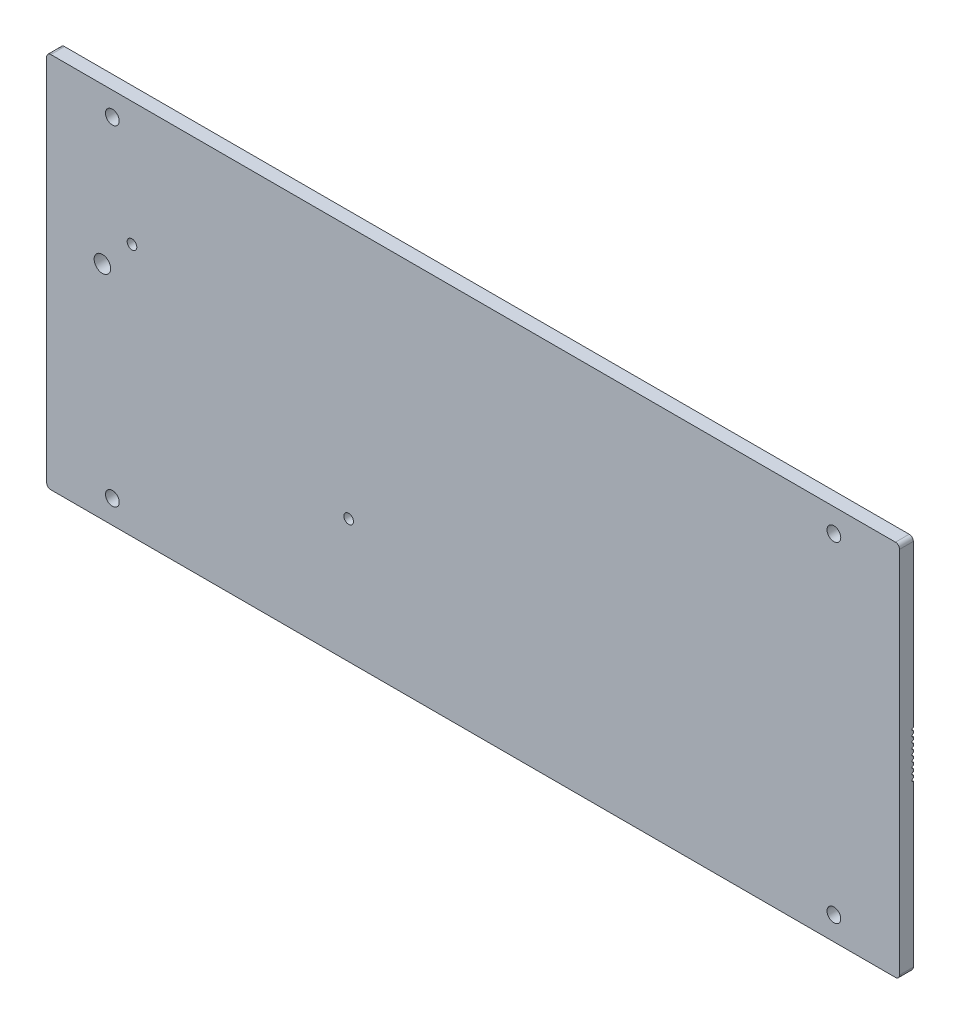
ISO-10303-21;
HEADER;
FILE_DESCRIPTION(('STEP AP214'),'2;1');
FILE_NAME('part.step','',(''),(''),'','','');
FILE_SCHEMA(('AUTOMOTIVE_DESIGN { 1 0 10303 214 1 1 1 1 }'));
ENDSEC;
DATA;
#1=APPLICATION_CONTEXT('core data for automotive mechanical design processes');
#2=APPLICATION_PROTOCOL_DEFINITION('international standard','automotive_design',2000,#1);
#3=PRODUCT_CONTEXT('',#1,'mechanical');
#4=PRODUCT('Part','Part','',(#3));
#5=PRODUCT_RELATED_PRODUCT_CATEGORY('part','',(#4));
#6=PRODUCT_DEFINITION_FORMATION('','',#4);
#7=PRODUCT_DEFINITION_CONTEXT('part definition',#1,'design');
#8=PRODUCT_DEFINITION('design','',#6,#7);
#9=PRODUCT_DEFINITION_SHAPE('','',#8);
#10=(LENGTH_UNIT() NAMED_UNIT(*) SI_UNIT(.MILLI.,.METRE.));
#11=(NAMED_UNIT(*) PLANE_ANGLE_UNIT() SI_UNIT($,.RADIAN.));
#12=(NAMED_UNIT(*) SI_UNIT($,.STERADIAN.) SOLID_ANGLE_UNIT());
#13=UNCERTAINTY_MEASURE_WITH_UNIT(LENGTH_MEASURE(1.E-05),#10,'distance_accuracy_value','');
#14=(GEOMETRIC_REPRESENTATION_CONTEXT(3) GLOBAL_UNCERTAINTY_ASSIGNED_CONTEXT((#13)) GLOBAL_UNIT_ASSIGNED_CONTEXT((#10,
#11,#12)) REPRESENTATION_CONTEXT('',''));
#15=CARTESIAN_POINT('',(0.,0.,0.));
#16=DIRECTION('',(0.,0.,1.));
#17=DIRECTION('',(1.,0.,0.));
#18=AXIS2_PLACEMENT_3D('',#15,#16,#17);
#19=CARTESIAN_POINT('',(-153.5,-67.,0.));
#20=DIRECTION('',(0.,0.,-1.));
#21=DIRECTION('',(-1.,0.,0.));
#22=AXIS2_PLACEMENT_3D('',#19,#20,#21);
#23=PLANE('',#22);
#24=DIRECTION('',(1.,0.,0.));
#25=VECTOR('',#24,1.);
#26=CARTESIAN_POINT('',(-155.,-7.5,0.));
#27=LINE('',#26,#25);
#28=CARTESIAN_POINT('',(-155.,-7.5,0.));
#29=VERTEX_POINT('',#28);
#30=CARTESIAN_POINT('',(155.,-7.5,0.));
#31=VERTEX_POINT('',#30);
#32=EDGE_CURVE('E325',#29,#31,#27,.T.);
#33=ORIENTED_EDGE('',*,*,#32,.F.);
#34=DIRECTION('',(0.,-1.,0.));
#35=VECTOR('',#34,1.);
#36=CARTESIAN_POINT('',(-155.,-67.,0.));
#37=LINE('',#36,#35);
#38=CARTESIAN_POINT('',(-155.,-6.5,0.));
#39=VERTEX_POINT('',#38);
#40=EDGE_CURVE('E448',#39,#29,#37,.T.);
#41=ORIENTED_EDGE('',*,*,#40,.F.);
#42=DIRECTION('',(1.,0.,0.));
#43=VECTOR('',#42,1.);
#44=CARTESIAN_POINT('',(-155.,-6.5,0.));
#45=LINE('',#44,#43);
#46=CARTESIAN_POINT('',(155.,-6.5,0.));
#47=VERTEX_POINT('',#46);
#48=EDGE_CURVE('E319',#47,#39,#45,.F.);
#49=ORIENTED_EDGE('',*,*,#48,.F.);
#50=DIRECTION('',(0.,1.,0.));
#51=VECTOR('',#50,1.);
#52=CARTESIAN_POINT('',(155.,-67.,0.));
#53=LINE('',#52,#51);
#54=EDGE_CURVE('E439',#31,#47,#53,.T.);
#55=ORIENTED_EDGE('',*,*,#54,.F.);
#56=EDGE_LOOP('',(#33,#41,#49,#55));
#57=FACE_BOUND('',#56,.T.);
#58=ADVANCED_FACE('F37',(#57),#23,.T.);
#59=DIRECTION('',(1.,0.,0.));
#60=VECTOR('',#59,1.);
#61=CARTESIAN_POINT('',(-155.,-5.5,0.));
#62=LINE('',#61,#60);
#63=CARTESIAN_POINT('',(-155.,-5.5,0.));
#64=VERTEX_POINT('',#63);
#65=CARTESIAN_POINT('',(155.,-5.5,0.));
#66=VERTEX_POINT('',#65);
#67=EDGE_CURVE('E321',#64,#66,#62,.T.);
#68=ORIENTED_EDGE('',*,*,#67,.F.);
#69=CARTESIAN_POINT('',(-155.,-4.5,0.));
#70=VERTEX_POINT('',#69);
#71=EDGE_CURVE('E451',#70,#64,#37,.T.);
#72=ORIENTED_EDGE('',*,*,#71,.F.);
#73=DIRECTION('',(1.,0.,0.));
#74=VECTOR('',#73,1.);
#75=CARTESIAN_POINT('',(-155.,-4.5,0.));
#76=LINE('',#75,#74);
#77=CARTESIAN_POINT('',(155.,-4.5,0.));
#78=VERTEX_POINT('',#77);
#79=EDGE_CURVE('E315',#78,#70,#76,.F.);
#80=ORIENTED_EDGE('',*,*,#79,.F.);
#81=EDGE_CURVE('E471',#66,#78,#53,.T.);
#82=ORIENTED_EDGE('',*,*,#81,.F.);
#83=EDGE_LOOP('',(#68,#72,#80,#82));
#84=FACE_BOUND('',#83,.T.);
#85=ADVANCED_FACE('F510',(#84),#23,.T.);
#86=DIRECTION('',(1.,0.,0.));
#87=VECTOR('',#86,1.);
#88=CARTESIAN_POINT('',(-155.,-3.5,0.));
#89=LINE('',#88,#87);
#90=CARTESIAN_POINT('',(-155.,-3.5,0.));
#91=VERTEX_POINT('',#90);
#92=CARTESIAN_POINT('',(155.,-3.5,0.));
#93=VERTEX_POINT('',#92);
#94=EDGE_CURVE('E317',#91,#93,#89,.T.);
#95=ORIENTED_EDGE('',*,*,#94,.F.);
#96=CARTESIAN_POINT('',(-155.,-2.5,0.));
#97=VERTEX_POINT('',#96);
#98=EDGE_CURVE('E251',#97,#91,#37,.T.);
#99=ORIENTED_EDGE('',*,*,#98,.F.);
#100=DIRECTION('',(1.,0.,0.));
#101=VECTOR('',#100,1.);
#102=CARTESIAN_POINT('',(-155.,-2.5,0.));
#103=LINE('',#102,#101);
#104=CARTESIAN_POINT('',(155.,-2.5,0.));
#105=VERTEX_POINT('',#104);
#106=EDGE_CURVE('E311',#105,#97,#103,.F.);
#107=ORIENTED_EDGE('',*,*,#106,.F.);
#108=EDGE_CURVE('E463',#93,#105,#53,.T.);
#109=ORIENTED_EDGE('',*,*,#108,.F.);
#110=EDGE_LOOP('',(#95,#99,#107,#109));
#111=FACE_BOUND('',#110,.T.);
#112=ADVANCED_FACE('F460',(#111),#23,.T.);
#113=DIRECTION('',(1.,0.,0.));
#114=VECTOR('',#113,1.);
#115=CARTESIAN_POINT('',(-155.,-1.5,0.));
#116=LINE('',#115,#114);
#117=CARTESIAN_POINT('',(-155.,-1.5,0.));
#118=VERTEX_POINT('',#117);
#119=CARTESIAN_POINT('',(155.,-1.5,0.));
#120=VERTEX_POINT('',#119);
#121=EDGE_CURVE('E313',#118,#120,#116,.T.);
#122=ORIENTED_EDGE('',*,*,#121,.F.);
#123=CARTESIAN_POINT('',(-155.,-0.5,0.));
#124=VERTEX_POINT('',#123);
#125=EDGE_CURVE('E248',#124,#118,#37,.T.);
#126=ORIENTED_EDGE('',*,*,#125,.F.);
#127=DIRECTION('',(1.,0.,0.));
#128=VECTOR('',#127,1.);
#129=CARTESIAN_POINT('',(-155.,-0.5,0.));
#130=LINE('',#129,#128);
#131=CARTESIAN_POINT('',(155.,-0.5,0.));
#132=VERTEX_POINT('',#131);
#133=EDGE_CURVE('E224',#132,#124,#130,.F.);
#134=ORIENTED_EDGE('',*,*,#133,.F.);
#135=EDGE_CURVE('E475',#120,#132,#53,.T.);
#136=ORIENTED_EDGE('',*,*,#135,.F.);
#137=EDGE_LOOP('',(#122,#126,#134,#136));
#138=FACE_BOUND('',#137,.T.);
#139=ADVANCED_FACE('F650',(#138),#23,.T.);
#140=CARTESIAN_POINT('',(-123.985873587784,23.4999999999989,0.));
#141=DIRECTION('',(0.,0.,-1.));
#142=DIRECTION('',(-1.,0.,0.));
#143=AXIS2_PLACEMENT_3D('',#140,#141,#142);
#144=CIRCLE('',#143,1.75);
#145=CARTESIAN_POINT('',(-125.735873587784,23.4999999999989,0.));
#146=VERTEX_POINT('',#145);
#147=EDGE_CURVE('E560',#146,#146,#144,.T.);
#148=ORIENTED_EDGE('',*,*,#147,.F.);
#149=EDGE_LOOP('',(#148));
#150=FACE_BOUND('',#149,.T.);
#151=DIRECTION('',(1.,0.,0.));
#152=VECTOR('',#151,1.);
#153=CARTESIAN_POINT('',(-155.,8.5,0.));
#154=LINE('',#153,#152);
#155=CARTESIAN_POINT('',(-134.351733035214,8.5,0.));
#156=VERTEX_POINT('',#155);
#157=CARTESIAN_POINT('',(155.,8.5,0.));
#158=VERTEX_POINT('',#157);
#159=EDGE_CURVE('E308',#156,#158,#154,.T.);
#160=ORIENTED_EDGE('',*,*,#159,.F.);
#161=CARTESIAN_POINT('',(-134.746454324871,11.9776709308805,0.));
#162=DIRECTION('',(0.,0.,-1.));
#163=DIRECTION('',(-1.,0.,0.));
#164=AXIS2_PLACEMENT_3D('',#161,#162,#163);
#165=CIRCLE('',#164,3.49999999999999);
#166=CARTESIAN_POINT('',(-135.141175614528,8.5,0.));
#167=VERTEX_POINT('',#166);
#168=EDGE_CURVE('E51',#156,#167,#165,.F.);
#169=ORIENTED_EDGE('',*,*,#168,.T.);
#170=CARTESIAN_POINT('',(-155.,8.5,0.));
#171=VERTEX_POINT('',#170);
#172=EDGE_CURVE('E309',#171,#167,#154,.T.);
#173=ORIENTED_EDGE('',*,*,#172,.F.);
#174=CARTESIAN_POINT('',(-155.,67.,0.));
#175=VERTEX_POINT('',#174);
#176=EDGE_CURVE('E252',#175,#171,#37,.T.);
#177=ORIENTED_EDGE('',*,*,#176,.F.);
#178=CARTESIAN_POINT('',(-153.5,67.,0.));
#179=DIRECTION('',(0.,0.,1.));
#180=DIRECTION('',(-1.,0.,0.));
#181=AXIS2_PLACEMENT_3D('',#178,#179,#180);
#182=CIRCLE('',#181,1.5);
#183=CARTESIAN_POINT('',(-153.5,68.5,0.));
#184=VERTEX_POINT('',#183);
#185=EDGE_CURVE('E260',#184,#175,#182,.T.);
#186=ORIENTED_EDGE('',*,*,#185,.F.);
#187=DIRECTION('',(-1.,0.,0.));
#188=VECTOR('',#187,1.);
#189=CARTESIAN_POINT('',(-153.5,68.5,0.));
#190=LINE('',#189,#188);
#191=CARTESIAN_POINT('',(153.5,68.5,0.));
#192=VERTEX_POINT('',#191);
#193=EDGE_CURVE('E440',#192,#184,#190,.T.);
#194=ORIENTED_EDGE('',*,*,#193,.F.);
#195=CARTESIAN_POINT('',(153.5,67.,0.));
#196=DIRECTION('',(0.,0.,1.));
#197=DIRECTION('',(-1.,0.,0.));
#198=AXIS2_PLACEMENT_3D('',#195,#196,#197);
#199=CIRCLE('',#198,1.5);
#200=CARTESIAN_POINT('',(155.,67.,0.));
#201=VERTEX_POINT('',#200);
#202=EDGE_CURVE('E438',#201,#192,#199,.T.);
#203=ORIENTED_EDGE('',*,*,#202,.F.);
#204=EDGE_CURVE('E434',#158,#201,#53,.T.);
#205=ORIENTED_EDGE('',*,*,#204,.F.);
#206=EDGE_LOOP('',(#160,#169,#173,#177,#186,#194,#203,#205));
#207=FACE_BOUND('',#206,.T.);
#208=CARTESIAN_POINT('',(131.119201541393,60.0000000000007,0.));
#209=DIRECTION('',(0.,0.,-1.));
#210=DIRECTION('',(1.,0.,0.));
#211=AXIS2_PLACEMENT_3D('',#208,#209,#210);
#212=CIRCLE('',#211,2.5);
#213=CARTESIAN_POINT('',(133.619201541393,60.0000000000007,0.));
#214=VERTEX_POINT('',#213);
#215=EDGE_CURVE('E391',#214,#214,#212,.T.);
#216=ORIENTED_EDGE('',*,*,#215,.F.);
#217=EDGE_LOOP('',(#216));
#218=FACE_BOUND('',#217,.T.);
#219=CARTESIAN_POINT('',(-131.119201541393,60.0000000000007,0.));
#220=DIRECTION('',(0.,0.,-1.));
#221=DIRECTION('',(-1.,0.,0.));
#222=AXIS2_PLACEMENT_3D('',#219,#220,#221);
#223=CIRCLE('',#222,2.50000000000064);
#224=CARTESIAN_POINT('',(-133.619201541394,60.0000000000007,0.));
#225=VERTEX_POINT('',#224);
#226=EDGE_CURVE('E397',#225,#225,#223,.T.);
#227=ORIENTED_EDGE('',*,*,#226,.F.);
#228=EDGE_LOOP('',(#227));
#229=FACE_BOUND('',#228,.T.);
#230=ADVANCED_FACE('F331',(#150,#207,#218,#229),#23,.T.);
#231=DIRECTION('',(1.,0.,0.));
#232=VECTOR('',#231,1.);
#233=CARTESIAN_POINT('',(-155.,7.5,0.));
#234=LINE('',#233,#232);
#235=CARTESIAN_POINT('',(155.,7.50000000000001,0.));
#236=VERTEX_POINT('',#235);
#237=CARTESIAN_POINT('',(-155.,7.5,0.));
#238=VERTEX_POINT('',#237);
#239=EDGE_CURVE('E305',#236,#238,#234,.F.);
#240=ORIENTED_EDGE('',*,*,#239,.F.);
#241=CARTESIAN_POINT('',(155.,6.5,0.));
#242=VERTEX_POINT('',#241);
#243=EDGE_CURVE('E483',#242,#236,#53,.T.);
#244=ORIENTED_EDGE('',*,*,#243,.F.);
#245=DIRECTION('',(1.,0.,0.));
#246=VECTOR('',#245,1.);
#247=CARTESIAN_POINT('',(-155.,6.5,0.));
#248=LINE('',#247,#246);
#249=CARTESIAN_POINT('',(-155.,6.5,0.));
#250=VERTEX_POINT('',#249);
#251=EDGE_CURVE('E302',#250,#242,#248,.T.);
#252=ORIENTED_EDGE('',*,*,#251,.F.);
#253=EDGE_CURVE('E258',#238,#250,#37,.T.);
#254=ORIENTED_EDGE('',*,*,#253,.F.);
#255=EDGE_LOOP('',(#240,#244,#252,#254));
#256=FACE_BOUND('',#255,.T.);
#257=ADVANCED_FACE('F547',(#256),#23,.T.);
#258=DIRECTION('',(1.,0.,0.));
#259=VECTOR('',#258,1.);
#260=CARTESIAN_POINT('',(-155.,5.5,0.));
#261=LINE('',#260,#259);
#262=CARTESIAN_POINT('',(155.,5.50000000000001,0.));
#263=VERTEX_POINT('',#262);
#264=CARTESIAN_POINT('',(-155.,5.5,0.));
#265=VERTEX_POINT('',#264);
#266=EDGE_CURVE('E299',#263,#265,#261,.F.);
#267=ORIENTED_EDGE('',*,*,#266,.F.);
#268=CARTESIAN_POINT('',(155.,4.5,0.));
#269=VERTEX_POINT('',#268);
#270=EDGE_CURVE('E480',#269,#263,#53,.T.);
#271=ORIENTED_EDGE('',*,*,#270,.F.);
#272=DIRECTION('',(1.,0.,0.));
#273=VECTOR('',#272,1.);
#274=CARTESIAN_POINT('',(-155.,4.5,0.));
#275=LINE('',#274,#273);
#276=CARTESIAN_POINT('',(-155.,4.5,0.));
#277=VERTEX_POINT('',#276);
#278=EDGE_CURVE('E296',#277,#269,#275,.T.);
#279=ORIENTED_EDGE('',*,*,#278,.F.);
#280=EDGE_CURVE('E250',#265,#277,#37,.T.);
#281=ORIENTED_EDGE('',*,*,#280,.F.);
#282=EDGE_LOOP('',(#267,#271,#279,#281));
#283=FACE_BOUND('',#282,.T.);
#284=ADVANCED_FACE('F542',(#283),#23,.T.);
#285=DIRECTION('',(1.,0.,0.));
#286=VECTOR('',#285,1.);
#287=CARTESIAN_POINT('',(-155.,3.5,0.));
#288=LINE('',#287,#286);
#289=CARTESIAN_POINT('',(155.,3.5,0.));
#290=VERTEX_POINT('',#289);
#291=CARTESIAN_POINT('',(-155.,3.5,0.));
#292=VERTEX_POINT('',#291);
#293=EDGE_CURVE('E293',#290,#292,#288,.F.);
#294=ORIENTED_EDGE('',*,*,#293,.F.);
#295=CARTESIAN_POINT('',(155.,2.5,0.));
#296=VERTEX_POINT('',#295);
#297=EDGE_CURVE('E478',#296,#290,#53,.T.);
#298=ORIENTED_EDGE('',*,*,#297,.F.);
#299=DIRECTION('',(1.,0.,0.));
#300=VECTOR('',#299,1.);
#301=CARTESIAN_POINT('',(-155.,2.5,0.));
#302=LINE('',#301,#300);
#303=CARTESIAN_POINT('',(-155.,2.5,0.));
#304=VERTEX_POINT('',#303);
#305=EDGE_CURVE('E290',#304,#296,#302,.T.);
#306=ORIENTED_EDGE('',*,*,#305,.F.);
#307=EDGE_CURVE('E247',#292,#304,#37,.T.);
#308=ORIENTED_EDGE('',*,*,#307,.F.);
#309=EDGE_LOOP('',(#294,#298,#306,#308));
#310=FACE_BOUND('',#309,.T.);
#311=ADVANCED_FACE('F535',(#310),#23,.T.);
#312=DIRECTION('',(1.,0.,0.));
#313=VECTOR('',#312,1.);
#314=CARTESIAN_POINT('',(-155.,1.5,0.));
#315=LINE('',#314,#313);
#316=CARTESIAN_POINT('',(155.,1.5,0.));
#317=VERTEX_POINT('',#316);
#318=CARTESIAN_POINT('',(-155.,1.5,0.));
#319=VERTEX_POINT('',#318);
#320=EDGE_CURVE('E241',#317,#319,#315,.F.);
#321=ORIENTED_EDGE('',*,*,#320,.F.);
#322=CARTESIAN_POINT('',(155.,0.5,0.));
#323=VERTEX_POINT('',#322);
#324=EDGE_CURVE('E239',#323,#317,#53,.T.);
#325=ORIENTED_EDGE('',*,*,#324,.F.);
#326=DIRECTION('',(1.,0.,0.));
#327=VECTOR('',#326,1.);
#328=CARTESIAN_POINT('',(-155.,0.5,0.));
#329=LINE('',#328,#327);
#330=CARTESIAN_POINT('',(-155.,0.5,0.));
#331=VERTEX_POINT('',#330);
#332=EDGE_CURVE('E221',#331,#323,#329,.T.);
#333=ORIENTED_EDGE('',*,*,#332,.F.);
#334=EDGE_CURVE('E237',#319,#331,#37,.T.);
#335=ORIENTED_EDGE('',*,*,#334,.F.);
#336=EDGE_LOOP('',(#321,#325,#333,#335));
#337=FACE_BOUND('',#336,.T.);
#338=ADVANCED_FACE('F236',(#337),#23,.T.);
#339=CARTESIAN_POINT('',(-153.5,-67.,5.));
#340=DIRECTION('',(0.,0.,-1.));
#341=DIRECTION('',(-1.,0.,0.));
#342=AXIS2_PLACEMENT_3D('',#339,#340,#341);
#343=CYLINDRICAL_SURFACE('',#342,1.5);
#344=CARTESIAN_POINT('',(-153.5,-67.,0.));
#345=DIRECTION('',(0.,0.,1.));
#346=DIRECTION('',(-1.,0.,0.));
#347=AXIS2_PLACEMENT_3D('',#344,#345,#346);
#348=CIRCLE('',#347,1.5);
#349=CARTESIAN_POINT('',(-155.,-67.,0.));
#350=VERTEX_POINT('',#349);
#351=CARTESIAN_POINT('',(-153.5,-68.5,0.));
#352=VERTEX_POINT('',#351);
#353=EDGE_CURVE('E408',#350,#352,#348,.T.);
#354=ORIENTED_EDGE('',*,*,#353,.T.);
#355=DIRECTION('',(0.,0.,-1.));
#356=VECTOR('',#355,1.);
#357=CARTESIAN_POINT('',(-153.5,-68.5,5.));
#358=LINE('',#357,#356);
#359=CARTESIAN_POINT('',(-153.5,-68.5,5.));
#360=VERTEX_POINT('',#359);
#361=EDGE_CURVE('E284',#360,#352,#358,.T.);
#362=ORIENTED_EDGE('',*,*,#361,.F.);
#363=CARTESIAN_POINT('',(-153.5,-67.,5.));
#364=DIRECTION('',(0.,0.,1.));
#365=DIRECTION('',(-1.,0.,0.));
#366=AXIS2_PLACEMENT_3D('',#363,#364,#365);
#367=CIRCLE('',#366,1.5);
#368=CARTESIAN_POINT('',(-155.,-67.,5.));
#369=VERTEX_POINT('',#368);
#370=EDGE_CURVE('E257',#369,#360,#367,.T.);
#371=ORIENTED_EDGE('',*,*,#370,.F.);
#372=DIRECTION('',(0.,0.,-1.));
#373=VECTOR('',#372,1.);
#374=CARTESIAN_POINT('',(-155.,-67.,5.));
#375=LINE('',#374,#373);
#376=EDGE_CURVE('E262',#369,#350,#375,.T.);
#377=ORIENTED_EDGE('',*,*,#376,.T.);
#378=EDGE_LOOP('',(#354,#362,#371,#377));
#379=FACE_BOUND('',#378,.T.);
#380=ADVANCED_FACE('F534',(#379),#343,.T.);
#381=CARTESIAN_POINT('',(-153.5,-68.5,5.));
#382=DIRECTION('',(0.,1.,0.));
#383=DIRECTION('',(0.,0.,1.));
#384=AXIS2_PLACEMENT_3D('',#381,#382,#383);
#385=PLANE('',#384);
#386=DIRECTION('',(1.,0.,0.));
#387=VECTOR('',#386,1.);
#388=CARTESIAN_POINT('',(-153.5,-68.5,0.));
#389=LINE('',#388,#387);
#390=CARTESIAN_POINT('',(153.5,-68.5,0.));
#391=VERTEX_POINT('',#390);
#392=EDGE_CURVE('E430',#352,#391,#389,.T.);
#393=ORIENTED_EDGE('',*,*,#392,.T.);
#394=DIRECTION('',(0.,0.,-1.));
#395=VECTOR('',#394,1.);
#396=CARTESIAN_POINT('',(153.5,-68.5,5.));
#397=LINE('',#396,#395);
#398=CARTESIAN_POINT('',(153.5,-68.5,5.));
#399=VERTEX_POINT('',#398);
#400=EDGE_CURVE('E281',#399,#391,#397,.T.);
#401=ORIENTED_EDGE('',*,*,#400,.F.);
#402=DIRECTION('',(1.,0.,0.));
#403=VECTOR('',#402,1.);
#404=CARTESIAN_POINT('',(-153.5,-68.5,5.));
#405=LINE('',#404,#403);
#406=EDGE_CURVE('E413',#360,#399,#405,.T.);
#407=ORIENTED_EDGE('',*,*,#406,.F.);
#408=ORIENTED_EDGE('',*,*,#361,.T.);
#409=EDGE_LOOP('',(#393,#401,#407,#408));
#410=FACE_BOUND('',#409,.T.);
#411=ADVANCED_FACE('F540',(#410),#385,.F.);
#412=CARTESIAN_POINT('',(153.5,-67.,5.));
#413=DIRECTION('',(0.,0.,-1.));
#414=DIRECTION('',(-1.,0.,0.));
#415=AXIS2_PLACEMENT_3D('',#412,#413,#414);
#416=CYLINDRICAL_SURFACE('',#415,1.5);
#417=CARTESIAN_POINT('',(153.5,-67.,0.));
#418=DIRECTION('',(0.,0.,1.));
#419=DIRECTION('',(1.,0.,0.));
#420=AXIS2_PLACEMENT_3D('',#417,#418,#419);
#421=CIRCLE('',#420,1.5);
#422=CARTESIAN_POINT('',(155.,-67.,0.));
#423=VERTEX_POINT('',#422);
#424=EDGE_CURVE('E432',#391,#423,#421,.T.);
#425=ORIENTED_EDGE('',*,*,#424,.T.);
#426=DIRECTION('',(0.,0.,-1.));
#427=VECTOR('',#426,1.);
#428=CARTESIAN_POINT('',(155.,-67.,5.));
#429=LINE('',#428,#427);
#430=CARTESIAN_POINT('',(155.,-67.,5.));
#431=VERTEX_POINT('',#430);
#432=EDGE_CURVE('E278',#431,#423,#429,.T.);
#433=ORIENTED_EDGE('',*,*,#432,.F.);
#434=CARTESIAN_POINT('',(153.5,-67.,5.));
#435=DIRECTION('',(0.,0.,1.));
#436=DIRECTION('',(1.,0.,0.));
#437=AXIS2_PLACEMENT_3D('',#434,#435,#436);
#438=CIRCLE('',#437,1.5);
#439=EDGE_CURVE('E415',#399,#431,#438,.T.);
#440=ORIENTED_EDGE('',*,*,#439,.F.);
#441=ORIENTED_EDGE('',*,*,#400,.T.);
#442=EDGE_LOOP('',(#425,#433,#440,#441));
#443=FACE_BOUND('',#442,.T.);
#444=ADVANCED_FACE('F726',(#443),#416,.T.);
#445=CARTESIAN_POINT('',(155.,-67.,5.));
#446=DIRECTION('',(-1.,0.,0.));
#447=DIRECTION('',(0.,0.,1.));
#448=AXIS2_PLACEMENT_3D('',#445,#446,#447);
#449=PLANE('',#448);
#450=CARTESIAN_POINT('',(155.,-8.5,0.));
#451=VERTEX_POINT('',#450);
#452=EDGE_CURVE('E435',#423,#451,#53,.T.);
#453=ORIENTED_EDGE('',*,*,#452,.T.);
#454=CARTESIAN_POINT('',(155.,-8.,0.));
#455=DIRECTION('',(-1.,0.,0.));
#456=DIRECTION('',(0.,0.,1.));
#457=AXIS2_PLACEMENT_3D('',#454,#455,#456);
#458=CIRCLE('',#457,0.5);
#459=EDGE_CURVE('E383',#451,#31,#458,.T.);
#460=ORIENTED_EDGE('',*,*,#459,.T.);
#461=ORIENTED_EDGE('',*,*,#54,.T.);
#462=CARTESIAN_POINT('',(155.,-6.,0.));
#463=DIRECTION('',(-1.,0.,0.));
#464=DIRECTION('',(0.,0.,1.));
#465=AXIS2_PLACEMENT_3D('',#462,#463,#464);
#466=CIRCLE('',#465,0.499999999999999);
#467=EDGE_CURVE('E380',#47,#66,#466,.T.);
#468=ORIENTED_EDGE('',*,*,#467,.T.);
#469=ORIENTED_EDGE('',*,*,#81,.T.);
#470=CARTESIAN_POINT('',(155.,-4.,0.));
#471=DIRECTION('',(-1.,0.,0.));
#472=DIRECTION('',(0.,0.,1.));
#473=AXIS2_PLACEMENT_3D('',#470,#471,#472);
#474=CIRCLE('',#473,0.5);
#475=EDGE_CURVE('E377',#78,#93,#474,.T.);
#476=ORIENTED_EDGE('',*,*,#475,.T.);
#477=ORIENTED_EDGE('',*,*,#108,.T.);
#478=CARTESIAN_POINT('',(155.,-2.,0.));
#479=DIRECTION('',(-1.,0.,0.));
#480=DIRECTION('',(0.,0.,1.));
#481=AXIS2_PLACEMENT_3D('',#478,#479,#480);
#482=CIRCLE('',#481,0.5);
#483=EDGE_CURVE('E374',#105,#120,#482,.T.);
#484=ORIENTED_EDGE('',*,*,#483,.T.);
#485=ORIENTED_EDGE('',*,*,#135,.T.);
#486=CARTESIAN_POINT('',(155.,0.,0.));
#487=DIRECTION('',(-1.,0.,0.));
#488=DIRECTION('',(0.,0.,1.));
#489=AXIS2_PLACEMENT_3D('',#486,#487,#488);
#490=CIRCLE('',#489,0.5);
#491=EDGE_CURVE('E229',#132,#323,#490,.T.);
#492=ORIENTED_EDGE('',*,*,#491,.T.);
#493=ORIENTED_EDGE('',*,*,#324,.T.);
#494=CARTESIAN_POINT('',(155.,2.,0.));
#495=DIRECTION('',(-1.,0.,0.));
#496=DIRECTION('',(0.,0.,1.));
#497=AXIS2_PLACEMENT_3D('',#494,#495,#496);
#498=CIRCLE('',#497,0.5);
#499=EDGE_CURVE('E362',#317,#296,#498,.T.);
#500=ORIENTED_EDGE('',*,*,#499,.T.);
#501=ORIENTED_EDGE('',*,*,#297,.T.);
#502=CARTESIAN_POINT('',(155.,4.,0.));
#503=DIRECTION('',(-1.,0.,0.));
#504=DIRECTION('',(0.,0.,1.));
#505=AXIS2_PLACEMENT_3D('',#502,#503,#504);
#506=CIRCLE('',#505,0.499999999999999);
#507=EDGE_CURVE('E365',#290,#269,#506,.T.);
#508=ORIENTED_EDGE('',*,*,#507,.T.);
#509=ORIENTED_EDGE('',*,*,#270,.T.);
#510=CARTESIAN_POINT('',(155.,6.,0.));
#511=DIRECTION('',(-1.,0.,0.));
#512=DIRECTION('',(0.,0.,1.));
#513=AXIS2_PLACEMENT_3D('',#510,#511,#512);
#514=CIRCLE('',#513,0.499999999999999);
#515=EDGE_CURVE('E368',#263,#242,#514,.T.);
#516=ORIENTED_EDGE('',*,*,#515,.T.);
#517=ORIENTED_EDGE('',*,*,#243,.T.);
#518=CARTESIAN_POINT('',(155.,8.,0.));
#519=DIRECTION('',(-1.,0.,0.));
#520=DIRECTION('',(0.,0.,1.));
#521=AXIS2_PLACEMENT_3D('',#518,#519,#520);
#522=CIRCLE('',#521,0.5);
#523=EDGE_CURVE('E371',#236,#158,#522,.T.);
#524=ORIENTED_EDGE('',*,*,#523,.T.);
#525=ORIENTED_EDGE('',*,*,#204,.T.);
#526=DIRECTION('',(0.,0.,-1.));
#527=VECTOR('',#526,1.);
#528=CARTESIAN_POINT('',(155.,67.,5.));
#529=LINE('',#528,#527);
#530=CARTESIAN_POINT('',(155.,67.,5.));
#531=VERTEX_POINT('',#530);
#532=EDGE_CURVE('E275',#531,#201,#529,.T.);
#533=ORIENTED_EDGE('',*,*,#532,.F.);
#534=DIRECTION('',(0.,1.,0.));
#535=VECTOR('',#534,1.);
#536=CARTESIAN_POINT('',(155.,-67.,5.));
#537=LINE('',#536,#535);
#538=EDGE_CURVE('E417',#431,#531,#537,.T.);
#539=ORIENTED_EDGE('',*,*,#538,.F.);
#540=ORIENTED_EDGE('',*,*,#432,.T.);
#541=EDGE_LOOP('',(#453,#460,#461,#468,#469,#476,#477,#484,#485,#492,#493,#500,#501,#508,#509,
#516,#517,#524,#525,#533,#539,#540));
#542=FACE_BOUND('',#541,.T.);
#543=ADVANCED_FACE('F469',(#542),#449,.F.);
#544=CARTESIAN_POINT('',(153.5,67.,5.));
#545=DIRECTION('',(0.,0.,-1.));
#546=DIRECTION('',(-1.,0.,0.));
#547=AXIS2_PLACEMENT_3D('',#544,#545,#546);
#548=CYLINDRICAL_SURFACE('',#547,1.5);
#549=ORIENTED_EDGE('',*,*,#202,.T.);
#550=DIRECTION('',(0.,0.,-1.));
#551=VECTOR('',#550,1.);
#552=CARTESIAN_POINT('',(153.5,68.5,5.));
#553=LINE('',#552,#551);
#554=CARTESIAN_POINT('',(153.5,68.5,5.));
#555=VERTEX_POINT('',#554);
#556=EDGE_CURVE('E272',#555,#192,#553,.T.);
#557=ORIENTED_EDGE('',*,*,#556,.F.);
#558=CARTESIAN_POINT('',(153.5,67.,5.));
#559=DIRECTION('',(0.,0.,1.));
#560=DIRECTION('',(-1.,0.,0.));
#561=AXIS2_PLACEMENT_3D('',#558,#559,#560);
#562=CIRCLE('',#561,1.5);
#563=EDGE_CURVE('E419',#531,#555,#562,.T.);
#564=ORIENTED_EDGE('',*,*,#563,.F.);
#565=ORIENTED_EDGE('',*,*,#532,.T.);
#566=EDGE_LOOP('',(#549,#557,#564,#565));
#567=FACE_BOUND('',#566,.T.);
#568=ADVANCED_FACE('F492',(#567),#548,.T.);
#569=CARTESIAN_POINT('',(-153.5,68.5,5.));
#570=DIRECTION('',(0.,-1.,0.));
#571=DIRECTION('',(0.,0.,-1.));
#572=AXIS2_PLACEMENT_3D('',#569,#570,#571);
#573=PLANE('',#572);
#574=ORIENTED_EDGE('',*,*,#193,.T.);
#575=DIRECTION('',(0.,0.,-1.));
#576=VECTOR('',#575,1.);
#577=CARTESIAN_POINT('',(-153.5,68.5,5.));
#578=LINE('',#577,#576);
#579=CARTESIAN_POINT('',(-153.5,68.5,5.));
#580=VERTEX_POINT('',#579);
#581=EDGE_CURVE('E269',#580,#184,#578,.T.);
#582=ORIENTED_EDGE('',*,*,#581,.F.);
#583=DIRECTION('',(-1.,0.,0.));
#584=VECTOR('',#583,1.);
#585=CARTESIAN_POINT('',(-153.5,68.5,5.));
#586=LINE('',#585,#584);
#587=EDGE_CURVE('E421',#555,#580,#586,.T.);
#588=ORIENTED_EDGE('',*,*,#587,.F.);
#589=ORIENTED_EDGE('',*,*,#556,.T.);
#590=EDGE_LOOP('',(#574,#582,#588,#589));
#591=FACE_BOUND('',#590,.T.);
#592=ADVANCED_FACE('F500',(#591),#573,.F.);
#593=CARTESIAN_POINT('',(-153.5,67.,5.));
#594=DIRECTION('',(0.,0.,-1.));
#595=DIRECTION('',(-1.,0.,0.));
#596=AXIS2_PLACEMENT_3D('',#593,#594,#595);
#597=CYLINDRICAL_SURFACE('',#596,1.5);
#598=ORIENTED_EDGE('',*,*,#185,.T.);
#599=DIRECTION('',(0.,0.,-1.));
#600=VECTOR('',#599,1.);
#601=CARTESIAN_POINT('',(-155.,67.,5.));
#602=LINE('',#601,#600);
#603=CARTESIAN_POINT('',(-155.,67.,5.));
#604=VERTEX_POINT('',#603);
#605=EDGE_CURVE('E265',#604,#175,#602,.T.);
#606=ORIENTED_EDGE('',*,*,#605,.F.);
#607=CARTESIAN_POINT('',(-153.5,67.,5.));
#608=DIRECTION('',(0.,0.,1.));
#609=DIRECTION('',(-1.,0.,0.));
#610=AXIS2_PLACEMENT_3D('',#607,#608,#609);
#611=CIRCLE('',#610,1.5);
#612=EDGE_CURVE('E424',#580,#604,#611,.T.);
#613=ORIENTED_EDGE('',*,*,#612,.F.);
#614=ORIENTED_EDGE('',*,*,#581,.T.);
#615=EDGE_LOOP('',(#598,#606,#613,#614));
#616=FACE_BOUND('',#615,.T.);
#617=ADVANCED_FACE('F496',(#616),#597,.T.);
#618=CARTESIAN_POINT('',(-155.,-67.,5.));
#619=DIRECTION('',(1.,0.,0.));
#620=DIRECTION('',(0.,0.,-1.));
#621=AXIS2_PLACEMENT_3D('',#618,#619,#620);
#622=PLANE('',#621);
#623=ORIENTED_EDGE('',*,*,#40,.T.);
#624=CARTESIAN_POINT('',(-155.,-8.,0.));
#625=DIRECTION('',(1.,0.,0.));
#626=DIRECTION('',(0.,0.,-1.));
#627=AXIS2_PLACEMENT_3D('',#624,#625,#626);
#628=CIRCLE('',#627,0.5);
#629=CARTESIAN_POINT('',(-155.,-8.5,0.));
#630=VERTEX_POINT('',#629);
#631=EDGE_CURVE('E357',#29,#630,#628,.T.);
#632=ORIENTED_EDGE('',*,*,#631,.T.);
#633=EDGE_CURVE('E259',#630,#350,#37,.T.);
#634=ORIENTED_EDGE('',*,*,#633,.T.);
#635=ORIENTED_EDGE('',*,*,#376,.F.);
#636=DIRECTION('',(0.,-1.,0.));
#637=VECTOR('',#636,1.);
#638=CARTESIAN_POINT('',(-155.,-67.,5.));
#639=LINE('',#638,#637);
#640=EDGE_CURVE('E266',#604,#369,#639,.T.);
#641=ORIENTED_EDGE('',*,*,#640,.F.);
#642=ORIENTED_EDGE('',*,*,#605,.T.);
#643=ORIENTED_EDGE('',*,*,#176,.T.);
#644=CARTESIAN_POINT('',(-155.,8.,0.));
#645=DIRECTION('',(1.,0.,0.));
#646=DIRECTION('',(0.,0.,-1.));
#647=AXIS2_PLACEMENT_3D('',#644,#645,#646);
#648=CIRCLE('',#647,0.5);
#649=EDGE_CURVE('E337',#171,#238,#648,.T.);
#650=ORIENTED_EDGE('',*,*,#649,.T.);
#651=ORIENTED_EDGE('',*,*,#253,.T.);
#652=CARTESIAN_POINT('',(-155.,6.,0.));
#653=DIRECTION('',(1.,0.,0.));
#654=DIRECTION('',(0.,0.,-1.));
#655=AXIS2_PLACEMENT_3D('',#652,#653,#654);
#656=CIRCLE('',#655,0.499999999999999);
#657=EDGE_CURVE('E341',#250,#265,#656,.T.);
#658=ORIENTED_EDGE('',*,*,#657,.T.);
#659=ORIENTED_EDGE('',*,*,#280,.T.);
#660=CARTESIAN_POINT('',(-155.,4.,0.));
#661=DIRECTION('',(1.,0.,0.));
#662=DIRECTION('',(0.,0.,-1.));
#663=AXIS2_PLACEMENT_3D('',#660,#661,#662);
#664=CIRCLE('',#663,0.499999999999999);
#665=EDGE_CURVE('E345',#277,#292,#664,.T.);
#666=ORIENTED_EDGE('',*,*,#665,.T.);
#667=ORIENTED_EDGE('',*,*,#307,.T.);
#668=CARTESIAN_POINT('',(-155.,2.,0.));
#669=DIRECTION('',(1.,0.,0.));
#670=DIRECTION('',(0.,0.,-1.));
#671=AXIS2_PLACEMENT_3D('',#668,#669,#670);
#672=CIRCLE('',#671,0.5);
#673=EDGE_CURVE('E230',#304,#319,#672,.T.);
#674=ORIENTED_EDGE('',*,*,#673,.T.);
#675=ORIENTED_EDGE('',*,*,#334,.T.);
#676=CARTESIAN_POINT('',(-155.,0.,0.));
#677=DIRECTION('',(1.,0.,0.));
#678=DIRECTION('',(0.,0.,-1.));
#679=AXIS2_PLACEMENT_3D('',#676,#677,#678);
#680=CIRCLE('',#679,0.5);
#681=EDGE_CURVE('E218',#331,#124,#680,.T.);
#682=ORIENTED_EDGE('',*,*,#681,.T.);
#683=ORIENTED_EDGE('',*,*,#125,.T.);
#684=CARTESIAN_POINT('',(-155.,-2.,0.));
#685=DIRECTION('',(1.,0.,0.));
#686=DIRECTION('',(0.,0.,-1.));
#687=AXIS2_PLACEMENT_3D('',#684,#685,#686);
#688=CIRCLE('',#687,0.5);
#689=EDGE_CURVE('E342',#118,#97,#688,.T.);
#690=ORIENTED_EDGE('',*,*,#689,.T.);
#691=ORIENTED_EDGE('',*,*,#98,.T.);
#692=CARTESIAN_POINT('',(-155.,-4.,0.));
#693=DIRECTION('',(1.,0.,0.));
#694=DIRECTION('',(0.,0.,-1.));
#695=AXIS2_PLACEMENT_3D('',#692,#693,#694);
#696=CIRCLE('',#695,0.5);
#697=EDGE_CURVE('E348',#91,#70,#696,.T.);
#698=ORIENTED_EDGE('',*,*,#697,.T.);
#699=ORIENTED_EDGE('',*,*,#71,.T.);
#700=CARTESIAN_POINT('',(-155.,-6.,0.));
#701=DIRECTION('',(1.,0.,0.));
#702=DIRECTION('',(0.,0.,-1.));
#703=AXIS2_PLACEMENT_3D('',#700,#701,#702);
#704=CIRCLE('',#703,0.499999999999999);
#705=EDGE_CURVE('E354',#64,#39,#704,.T.);
#706=ORIENTED_EDGE('',*,*,#705,.T.);
#707=EDGE_LOOP('',(#623,#632,#634,#635,#641,#642,#643,#650,#651,#658,#659,#666,#667,#674,#675,
#682,#683,#690,#691,#698,#699,#706));
#708=FACE_BOUND('',#707,.T.);
#709=ADVANCED_FACE('F245',(#708),#622,.F.);
#710=CARTESIAN_POINT('',(-153.5,-67.,5.));
#711=DIRECTION('',(0.,0.,-1.));
#712=DIRECTION('',(-1.,0.,0.));
#713=AXIS2_PLACEMENT_3D('',#710,#711,#712);
#714=PLANE('',#713);
#715=CARTESIAN_POINT('',(-134.746454324871,11.9776709308805,5.));
#716=DIRECTION('',(0.,0.,-1.));
#717=DIRECTION('',(-1.,0.,0.));
#718=AXIS2_PLACEMENT_3D('',#715,#716,#717);
#719=CIRCLE('',#718,2.99999999999999);
#720=CARTESIAN_POINT('',(-137.746454324871,11.9776709308805,5.));
#721=VERTEX_POINT('',#720);
#722=EDGE_CURVE('E564',#721,#721,#719,.T.);
#723=ORIENTED_EDGE('',*,*,#722,.T.);
#724=EDGE_LOOP('',(#723));
#725=FACE_BOUND('',#724,.T.);
#726=CARTESIAN_POINT('',(-45.2358735877839,-23.5000000000008,5.));
#727=DIRECTION('',(0.,0.,-1.));
#728=DIRECTION('',(-1.,0.,0.));
#729=AXIS2_PLACEMENT_3D('',#726,#727,#728);
#730=CIRCLE('',#729,1.75);
#731=CARTESIAN_POINT('',(-46.9858735877839,-23.5000000000008,5.));
#732=VERTEX_POINT('',#731);
#733=EDGE_CURVE('E359',#732,#732,#730,.T.);
#734=ORIENTED_EDGE('',*,*,#733,.T.);
#735=EDGE_LOOP('',(#734));
#736=FACE_BOUND('',#735,.T.);
#737=CARTESIAN_POINT('',(-123.985873587784,23.4999999999989,5.));
#738=DIRECTION('',(0.,0.,-1.));
#739=DIRECTION('',(-1.,0.,0.));
#740=AXIS2_PLACEMENT_3D('',#737,#738,#739);
#741=CIRCLE('',#740,1.75);
#742=CARTESIAN_POINT('',(-125.735873587784,23.4999999999989,5.));
#743=VERTEX_POINT('',#742);
#744=EDGE_CURVE('E563',#743,#743,#741,.T.);
#745=ORIENTED_EDGE('',*,*,#744,.T.);
#746=EDGE_LOOP('',(#745));
#747=FACE_BOUND('',#746,.T.);
#748=CARTESIAN_POINT('',(-131.119201541393,-60.0000000000007,5.));
#749=DIRECTION('',(0.,0.,-1.));
#750=DIRECTION('',(1.,0.,0.));
#751=AXIS2_PLACEMENT_3D('',#748,#749,#750);
#752=CIRCLE('',#751,2.49999999999936);
#753=CARTESIAN_POINT('',(-128.619201541394,-60.0000000000007,5.));
#754=VERTEX_POINT('',#753);
#755=EDGE_CURVE('E400',#754,#754,#752,.T.);
#756=ORIENTED_EDGE('',*,*,#755,.T.);
#757=EDGE_LOOP('',(#756));
#758=FACE_BOUND('',#757,.T.);
#759=CARTESIAN_POINT('',(-131.119201541393,60.0000000000007,5.));
#760=DIRECTION('',(0.,0.,-1.));
#761=DIRECTION('',(-1.,0.,0.));
#762=AXIS2_PLACEMENT_3D('',#759,#760,#761);
#763=CIRCLE('',#762,2.50000000000064);
#764=CARTESIAN_POINT('',(-133.619201541394,60.0000000000007,5.));
#765=VERTEX_POINT('',#764);
#766=EDGE_CURVE('E394',#765,#765,#763,.T.);
#767=ORIENTED_EDGE('',*,*,#766,.T.);
#768=EDGE_LOOP('',(#767));
#769=FACE_BOUND('',#768,.T.);
#770=CARTESIAN_POINT('',(131.119201541393,60.0000000000007,5.));
#771=DIRECTION('',(0.,0.,-1.));
#772=DIRECTION('',(1.,0.,0.));
#773=AXIS2_PLACEMENT_3D('',#770,#771,#772);
#774=CIRCLE('',#773,2.5);
#775=CARTESIAN_POINT('',(133.619201541393,60.0000000000007,5.));
#776=VERTEX_POINT('',#775);
#777=EDGE_CURVE('E387',#776,#776,#774,.T.);
#778=ORIENTED_EDGE('',*,*,#777,.T.);
#779=EDGE_LOOP('',(#778));
#780=FACE_BOUND('',#779,.T.);
#781=CARTESIAN_POINT('',(131.119201541393,-60.0000000000006,5.));
#782=DIRECTION('',(0.,0.,-1.));
#783=DIRECTION('',(-1.,0.,0.));
#784=AXIS2_PLACEMENT_3D('',#781,#782,#783);
#785=CIRCLE('',#784,2.5);
#786=CARTESIAN_POINT('',(128.619201541393,-60.0000000000006,5.));
#787=VERTEX_POINT('',#786);
#788=EDGE_CURVE('E405',#787,#787,#785,.T.);
#789=ORIENTED_EDGE('',*,*,#788,.T.);
#790=EDGE_LOOP('',(#789));
#791=FACE_BOUND('',#790,.T.);
#792=ORIENTED_EDGE('',*,*,#370,.T.);
#793=ORIENTED_EDGE('',*,*,#406,.T.);
#794=ORIENTED_EDGE('',*,*,#439,.T.);
#795=ORIENTED_EDGE('',*,*,#538,.T.);
#796=ORIENTED_EDGE('',*,*,#563,.T.);
#797=ORIENTED_EDGE('',*,*,#587,.T.);
#798=ORIENTED_EDGE('',*,*,#612,.T.);
#799=ORIENTED_EDGE('',*,*,#640,.T.);
#800=EDGE_LOOP('',(#792,#793,#794,#795,#796,#797,#798,#799));
#801=FACE_BOUND('',#800,.T.);
#802=ADVANCED_FACE('F498',(#725,#736,#747,#758,#769,#780,#791,#801),#714,.F.);
#803=CARTESIAN_POINT('',(-45.2358735877839,-23.5000000000008,0.));
#804=DIRECTION('',(0.,0.,-1.));
#805=DIRECTION('',(-1.,0.,0.));
#806=AXIS2_PLACEMENT_3D('',#803,#804,#805);
#807=CIRCLE('',#806,1.75);
#808=CARTESIAN_POINT('',(-46.9858735877839,-23.5000000000008,0.));
#809=VERTEX_POINT('',#808);
#810=EDGE_CURVE('E567',#809,#809,#807,.T.);
#811=ORIENTED_EDGE('',*,*,#810,.F.);
#812=EDGE_LOOP('',(#811));
#813=FACE_BOUND('',#812,.T.);
#814=DIRECTION('',(1.,0.,0.));
#815=VECTOR('',#814,1.);
#816=CARTESIAN_POINT('',(-155.,-8.5,0.));
#817=LINE('',#816,#815);
#818=EDGE_CURVE('E323',#451,#630,#817,.F.);
#819=ORIENTED_EDGE('',*,*,#818,.F.);
#820=ORIENTED_EDGE('',*,*,#452,.F.);
#821=ORIENTED_EDGE('',*,*,#424,.F.);
#822=ORIENTED_EDGE('',*,*,#392,.F.);
#823=ORIENTED_EDGE('',*,*,#353,.F.);
#824=ORIENTED_EDGE('',*,*,#633,.F.);
#825=EDGE_LOOP('',(#819,#820,#821,#822,#823,#824));
#826=FACE_BOUND('',#825,.T.);
#827=CARTESIAN_POINT('',(-131.119201541393,-60.0000000000007,0.));
#828=DIRECTION('',(0.,0.,-1.));
#829=DIRECTION('',(1.,0.,0.));
#830=AXIS2_PLACEMENT_3D('',#827,#828,#829);
#831=CIRCLE('',#830,2.49999999999936);
#832=CARTESIAN_POINT('',(-128.619201541394,-60.0000000000007,0.));
#833=VERTEX_POINT('',#832);
#834=EDGE_CURVE('E386',#833,#833,#831,.T.);
#835=ORIENTED_EDGE('',*,*,#834,.F.);
#836=EDGE_LOOP('',(#835));
#837=FACE_BOUND('',#836,.T.);
#838=CARTESIAN_POINT('',(131.119201541393,-60.0000000000006,0.));
#839=DIRECTION('',(0.,0.,-1.));
#840=DIRECTION('',(-1.,0.,0.));
#841=AXIS2_PLACEMENT_3D('',#838,#839,#840);
#842=CIRCLE('',#841,2.5);
#843=CARTESIAN_POINT('',(128.619201541393,-60.0000000000006,0.));
#844=VERTEX_POINT('',#843);
#845=EDGE_CURVE('E390',#844,#844,#842,.T.);
#846=ORIENTED_EDGE('',*,*,#845,.F.);
#847=EDGE_LOOP('',(#846));
#848=FACE_BOUND('',#847,.T.);
#849=ADVANCED_FACE('F513',(#813,#826,#837,#848),#23,.T.);
#850=CARTESIAN_POINT('',(131.119201541393,-60.0000000000006,5.));
#851=DIRECTION('',(0.,0.,-1.));
#852=DIRECTION('',(-1.,0.,0.));
#853=AXIS2_PLACEMENT_3D('',#850,#851,#852);
#854=CYLINDRICAL_SURFACE('',#853,2.5);
#855=ORIENTED_EDGE('',*,*,#788,.F.);
#856=EDGE_LOOP('',(#855));
#857=FACE_BOUND('',#856,.T.);
#858=ORIENTED_EDGE('',*,*,#845,.T.);
#859=EDGE_LOOP('',(#858));
#860=FACE_BOUND('',#859,.T.);
#861=ADVANCED_FACE('F521',(#857,#860),#854,.F.);
#862=CARTESIAN_POINT('',(131.119201541393,60.0000000000007,5.));
#863=DIRECTION('',(0.,0.,-1.));
#864=DIRECTION('',(-1.,0.,0.));
#865=AXIS2_PLACEMENT_3D('',#862,#863,#864);
#866=CYLINDRICAL_SURFACE('',#865,2.5);
#867=ORIENTED_EDGE('',*,*,#777,.F.);
#868=EDGE_LOOP('',(#867));
#869=FACE_BOUND('',#868,.T.);
#870=ORIENTED_EDGE('',*,*,#215,.T.);
#871=EDGE_LOOP('',(#870));
#872=FACE_BOUND('',#871,.T.);
#873=ADVANCED_FACE('F527',(#869,#872),#866,.F.);
#874=CARTESIAN_POINT('',(-131.119201541393,60.0000000000007,5.));
#875=DIRECTION('',(0.,0.,-1.));
#876=DIRECTION('',(-1.,0.,0.));
#877=AXIS2_PLACEMENT_3D('',#874,#875,#876);
#878=CYLINDRICAL_SURFACE('',#877,2.50000000000064);
#879=ORIENTED_EDGE('',*,*,#766,.F.);
#880=EDGE_LOOP('',(#879));
#881=FACE_BOUND('',#880,.T.);
#882=ORIENTED_EDGE('',*,*,#226,.T.);
#883=EDGE_LOOP('',(#882));
#884=FACE_BOUND('',#883,.T.);
#885=ADVANCED_FACE('F623',(#881,#884),#878,.F.);
#886=CARTESIAN_POINT('',(-131.119201541393,-60.0000000000007,5.));
#887=DIRECTION('',(0.,0.,-1.));
#888=DIRECTION('',(-1.,0.,0.));
#889=AXIS2_PLACEMENT_3D('',#886,#887,#888);
#890=CYLINDRICAL_SURFACE('',#889,2.49999999999936);
#891=ORIENTED_EDGE('',*,*,#755,.F.);
#892=EDGE_LOOP('',(#891));
#893=FACE_BOUND('',#892,.T.);
#894=ORIENTED_EDGE('',*,*,#834,.T.);
#895=EDGE_LOOP('',(#894));
#896=FACE_BOUND('',#895,.T.);
#897=ADVANCED_FACE('F620',(#893,#896),#890,.F.);
#898=CARTESIAN_POINT('',(-155.,0.,0.));
#899=DIRECTION('',(1.,0.,0.));
#900=DIRECTION('',(0.,0.,-1.));
#901=AXIS2_PLACEMENT_3D('',#898,#899,#900);
#902=CYLINDRICAL_SURFACE('',#901,0.5);
#903=ORIENTED_EDGE('',*,*,#332,.T.);
#904=ORIENTED_EDGE('',*,*,#491,.F.);
#905=ORIENTED_EDGE('',*,*,#133,.T.);
#906=ORIENTED_EDGE('',*,*,#681,.F.);
#907=EDGE_LOOP('',(#903,#904,#905,#906));
#908=FACE_BOUND('',#907,.T.);
#909=ADVANCED_FACE('F220',(#908),#902,.F.);
#910=CARTESIAN_POINT('',(-155.,2.,0.));
#911=DIRECTION('',(1.,0.,0.));
#912=DIRECTION('',(0.,0.,-1.));
#913=AXIS2_PLACEMENT_3D('',#910,#911,#912);
#914=CYLINDRICAL_SURFACE('',#913,0.5);
#915=ORIENTED_EDGE('',*,*,#305,.T.);
#916=ORIENTED_EDGE('',*,*,#499,.F.);
#917=ORIENTED_EDGE('',*,*,#320,.T.);
#918=ORIENTED_EDGE('',*,*,#673,.F.);
#919=EDGE_LOOP('',(#915,#916,#917,#918));
#920=FACE_BOUND('',#919,.T.);
#921=ADVANCED_FACE('F593',(#920),#914,.F.);
#922=CARTESIAN_POINT('',(-155.,4.,0.));
#923=DIRECTION('',(1.,0.,0.));
#924=DIRECTION('',(0.,0.,-1.));
#925=AXIS2_PLACEMENT_3D('',#922,#923,#924);
#926=CYLINDRICAL_SURFACE('',#925,0.499999999999999);
#927=ORIENTED_EDGE('',*,*,#278,.T.);
#928=ORIENTED_EDGE('',*,*,#507,.F.);
#929=ORIENTED_EDGE('',*,*,#293,.T.);
#930=ORIENTED_EDGE('',*,*,#665,.F.);
#931=EDGE_LOOP('',(#927,#928,#929,#930));
#932=FACE_BOUND('',#931,.T.);
#933=ADVANCED_FACE('F554',(#932),#926,.F.);
#934=CARTESIAN_POINT('',(-155.,6.,0.));
#935=DIRECTION('',(1.,0.,0.));
#936=DIRECTION('',(0.,0.,-1.));
#937=AXIS2_PLACEMENT_3D('',#934,#935,#936);
#938=CYLINDRICAL_SURFACE('',#937,0.499999999999999);
#939=ORIENTED_EDGE('',*,*,#251,.T.);
#940=ORIENTED_EDGE('',*,*,#515,.F.);
#941=ORIENTED_EDGE('',*,*,#266,.T.);
#942=ORIENTED_EDGE('',*,*,#657,.F.);
#943=EDGE_LOOP('',(#939,#940,#941,#942));
#944=FACE_BOUND('',#943,.T.);
#945=ADVANCED_FACE('F599',(#944),#938,.F.);
#946=CARTESIAN_POINT('',(-155.,8.,0.));
#947=DIRECTION('',(1.,0.,0.));
#948=DIRECTION('',(0.,0.,-1.));
#949=AXIS2_PLACEMENT_3D('',#946,#947,#948);
#950=CYLINDRICAL_SURFACE('',#949,0.5);
#951=ORIENTED_EDGE('',*,*,#172,.T.);
#952=CARTESIAN_POINT('',(-135.141175614528,8.5,0.));
#953=CARTESIAN_POINT('',(-135.075388694971,8.50000006128996,4.08925235181683E-05));
#954=CARTESIAN_POINT('',(-135.009601749575,8.49999999908314,0.000165599013506711));
#955=CARTESIAN_POINT('',(-134.878027977743,8.49999984402488,0.000394565250263724));
#956=CARTESIAN_POINT('',(-134.812241151307,8.49999975117352,0.000498825042035543));
#957=CARTESIAN_POINT('',(-134.680667498435,8.49999975117352,0.000498825042038956));
#958=CARTESIAN_POINT('',(-134.614880672,8.49999984402488,0.00039456525027049));
#959=CARTESIAN_POINT('',(-134.483306900167,8.49999999908314,0.000165599013499795));
#960=CARTESIAN_POINT('',(-134.417519954771,8.50000006128996,4.08925234942272E-05));
#961=CARTESIAN_POINT('',(-134.351733035214,8.5,0.));
#962=B_SPLINE_CURVE_WITH_KNOTS('',3,(#952,#953,#954,#955,#956,#957,#958,#959,#960,#961),
.UNSPECIFIED.,.F.,.F.,(4,2,2,2,4),(0.,0.197361022006907,0.394721609615725,0.5920821972246,
0.789443219231451),.UNSPECIFIED.);
#963=EDGE_CURVE('E11',#167,#156,#962,.T.);
#964=ORIENTED_EDGE('',*,*,#963,.T.);
#965=ORIENTED_EDGE('',*,*,#159,.T.);
#966=ORIENTED_EDGE('',*,*,#523,.F.);
#967=ORIENTED_EDGE('',*,*,#239,.T.);
#968=ORIENTED_EDGE('',*,*,#649,.F.);
#969=EDGE_LOOP('',(#951,#964,#965,#966,#967,#968));
#970=FACE_BOUND('',#969,.T.);
#971=ADVANCED_FACE('F335',(#970),#950,.F.);
#972=CARTESIAN_POINT('',(-155.,-2.,0.));
#973=DIRECTION('',(1.,0.,0.));
#974=DIRECTION('',(0.,0.,-1.));
#975=AXIS2_PLACEMENT_3D('',#972,#973,#974);
#976=CYLINDRICAL_SURFACE('',#975,0.5);
#977=ORIENTED_EDGE('',*,*,#121,.T.);
#978=ORIENTED_EDGE('',*,*,#483,.F.);
#979=ORIENTED_EDGE('',*,*,#106,.T.);
#980=ORIENTED_EDGE('',*,*,#689,.F.);
#981=EDGE_LOOP('',(#977,#978,#979,#980));
#982=FACE_BOUND('',#981,.T.);
#983=ADVANCED_FACE('F605',(#982),#976,.F.);
#984=CARTESIAN_POINT('',(-155.,-4.,0.));
#985=DIRECTION('',(1.,0.,0.));
#986=DIRECTION('',(0.,0.,-1.));
#987=AXIS2_PLACEMENT_3D('',#984,#985,#986);
#988=CYLINDRICAL_SURFACE('',#987,0.5);
#989=ORIENTED_EDGE('',*,*,#94,.T.);
#990=ORIENTED_EDGE('',*,*,#475,.F.);
#991=ORIENTED_EDGE('',*,*,#79,.T.);
#992=ORIENTED_EDGE('',*,*,#697,.F.);
#993=EDGE_LOOP('',(#989,#990,#991,#992));
#994=FACE_BOUND('',#993,.T.);
#995=ADVANCED_FACE('F465',(#994),#988,.F.);
#996=CARTESIAN_POINT('',(-155.,-6.,0.));
#997=DIRECTION('',(1.,0.,0.));
#998=DIRECTION('',(0.,0.,-1.));
#999=AXIS2_PLACEMENT_3D('',#996,#997,#998);
#1000=CYLINDRICAL_SURFACE('',#999,0.499999999999999);
#1001=ORIENTED_EDGE('',*,*,#67,.T.);
#1002=ORIENTED_EDGE('',*,*,#467,.F.);
#1003=ORIENTED_EDGE('',*,*,#48,.T.);
#1004=ORIENTED_EDGE('',*,*,#705,.F.);
#1005=EDGE_LOOP('',(#1001,#1002,#1003,#1004));
#1006=FACE_BOUND('',#1005,.T.);
#1007=ADVANCED_FACE('F611',(#1006),#1000,.F.);
#1008=CARTESIAN_POINT('',(-155.,-8.,0.));
#1009=DIRECTION('',(1.,0.,0.));
#1010=DIRECTION('',(0.,0.,-1.));
#1011=AXIS2_PLACEMENT_3D('',#1008,#1009,#1010);
#1012=CYLINDRICAL_SURFACE('',#1011,0.5);
#1013=ORIENTED_EDGE('',*,*,#32,.T.);
#1014=ORIENTED_EDGE('',*,*,#459,.F.);
#1015=ORIENTED_EDGE('',*,*,#818,.T.);
#1016=ORIENTED_EDGE('',*,*,#631,.F.);
#1017=EDGE_LOOP('',(#1013,#1014,#1015,#1016));
#1018=FACE_BOUND('',#1017,.T.);
#1019=ADVANCED_FACE('F590',(#1018),#1012,.F.);
#1020=CARTESIAN_POINT('',(-45.2358735877839,-23.5000000000008,5.));
#1021=DIRECTION('',(0.,0.,-1.));
#1022=DIRECTION('',(-1.,0.,0.));
#1023=AXIS2_PLACEMENT_3D('',#1020,#1021,#1022);
#1024=CYLINDRICAL_SURFACE('',#1023,1.75);
#1025=ORIENTED_EDGE('',*,*,#733,.F.);
#1026=EDGE_LOOP('',(#1025));
#1027=FACE_BOUND('',#1026,.T.);
#1028=ORIENTED_EDGE('',*,*,#810,.T.);
#1029=EDGE_LOOP('',(#1028));
#1030=FACE_BOUND('',#1029,.T.);
#1031=ADVANCED_FACE('F585',(#1027,#1030),#1024,.F.);
#1032=CARTESIAN_POINT('',(-123.985873587784,23.4999999999989,5.));
#1033=DIRECTION('',(0.,0.,-1.));
#1034=DIRECTION('',(-1.,0.,0.));
#1035=AXIS2_PLACEMENT_3D('',#1032,#1033,#1034);
#1036=CYLINDRICAL_SURFACE('',#1035,1.75);
#1037=ORIENTED_EDGE('',*,*,#744,.F.);
#1038=EDGE_LOOP('',(#1037));
#1039=FACE_BOUND('',#1038,.T.);
#1040=ORIENTED_EDGE('',*,*,#147,.T.);
#1041=EDGE_LOOP('',(#1040));
#1042=FACE_BOUND('',#1041,.T.);
#1043=ADVANCED_FACE('F578',(#1039,#1042),#1036,.F.);
#1044=CARTESIAN_POINT('',(-134.746454324871,11.9776709308805,5.));
#1045=DIRECTION('',(0.,0.,-1.));
#1046=DIRECTION('',(-1.,0.,0.));
#1047=AXIS2_PLACEMENT_3D('',#1044,#1045,#1046);
#1048=CYLINDRICAL_SURFACE('',#1047,2.99999999999999);
#1049=CARTESIAN_POINT('',(-134.746454324871,11.9776709308805,0.5));
#1050=DIRECTION('',(0.,0.,-1.));
#1051=DIRECTION('',(-1.,0.,0.));
#1052=AXIS2_PLACEMENT_3D('',#1049,#1050,#1051);
#1053=CIRCLE('',#1052,2.99999999999999);
#1054=CARTESIAN_POINT('',(-137.746454324871,11.9776709308805,0.5));
#1055=VERTEX_POINT('',#1054);
#1056=EDGE_CURVE('E327',#1055,#1055,#1053,.T.);
#1057=ORIENTED_EDGE('',*,*,#1056,.T.);
#1058=EDGE_LOOP('',(#1057));
#1059=FACE_BOUND('',#1058,.T.);
#1060=ORIENTED_EDGE('',*,*,#722,.F.);
#1061=EDGE_LOOP('',(#1060));
#1062=FACE_BOUND('',#1061,.T.);
#1063=ADVANCED_FACE('F576',(#1059,#1062),#1048,.F.);
#1064=CARTESIAN_POINT('',(-134.746454324871,11.9776709308805,0.5));
#1065=DIRECTION('',(0.,0.,-1.));
#1066=DIRECTION('',(-1.,0.,0.));
#1067=AXIS2_PLACEMENT_3D('',#1064,#1065,#1066);
#1068=TOROIDAL_SURFACE('',#1067,3.49999999999999,0.5);
#1069=ORIENTED_EDGE('',*,*,#963,.F.);
#1070=ORIENTED_EDGE('',*,*,#168,.F.);
#1071=EDGE_LOOP('',(#1069,#1070));
#1072=FACE_BOUND('',#1071,.T.);
#1073=ORIENTED_EDGE('',*,*,#1056,.F.);
#1074=EDGE_LOOP('',(#1073));
#1075=FACE_BOUND('',#1074,.T.);
#1076=ADVANCED_FACE('F39',(#1072,#1075),#1068,.T.);
#1077=CLOSED_SHELL('',(#58,#85,#112,#139,#230,#257,#284,#311,#338,#380,#411,#444,#543,#568,#592,
#617,#709,#802,#849,#861,#873,#885,#897,#909,#921,#933,#945,#971,#983,#995,#1007,#1019,#1031,
#1043,#1063,#1076));
#1078=MANIFOLD_SOLID_BREP('B2',#1077);
#1079=ADVANCED_BREP_SHAPE_REPRESENTATION('',(#18,#1078),#14);
#1080=SHAPE_DEFINITION_REPRESENTATION(#9,#1079);
ENDSEC;
END-ISO-10303-21;
